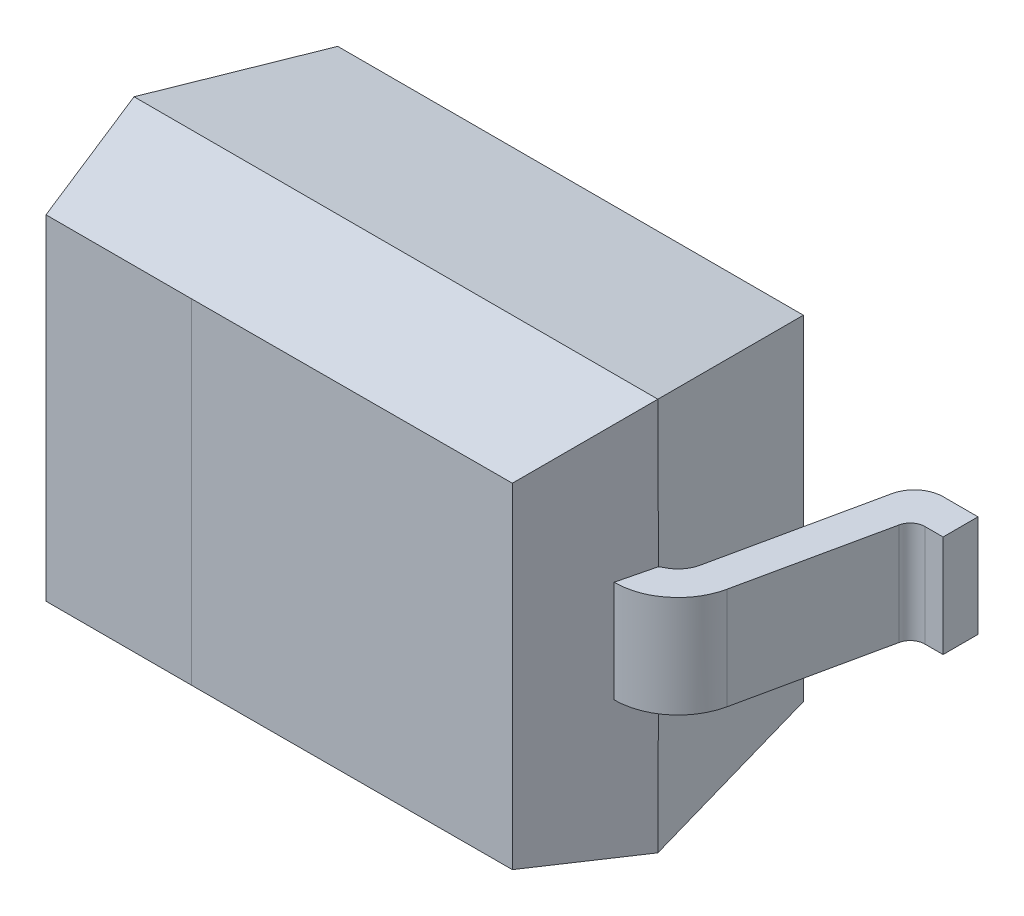
ISO-10303-21;
HEADER;
FILE_DESCRIPTION(('STEP AP214'),'2;1');
FILE_NAME('part.step','',(''),(''),'','','');
FILE_SCHEMA(('AUTOMOTIVE_DESIGN { 1 0 10303 214 1 1 1 1 }'));
ENDSEC;
DATA;
#1=APPLICATION_CONTEXT('core data for automotive mechanical design processes');
#2=APPLICATION_PROTOCOL_DEFINITION('international standard','automotive_design',2000,#1);
#3=PRODUCT_CONTEXT('',#1,'mechanical');
#4=PRODUCT('Part','Part','',(#3));
#5=PRODUCT_RELATED_PRODUCT_CATEGORY('part','',(#4));
#6=PRODUCT_DEFINITION_FORMATION('','',#4);
#7=PRODUCT_DEFINITION_CONTEXT('part definition',#1,'design');
#8=PRODUCT_DEFINITION('design','',#6,#7);
#9=PRODUCT_DEFINITION_SHAPE('','',#8);
#10=(LENGTH_UNIT() NAMED_UNIT(*) SI_UNIT(.MILLI.,.METRE.));
#11=(NAMED_UNIT(*) PLANE_ANGLE_UNIT() SI_UNIT($,.RADIAN.));
#12=(NAMED_UNIT(*) SI_UNIT($,.STERADIAN.) SOLID_ANGLE_UNIT());
#13=UNCERTAINTY_MEASURE_WITH_UNIT(LENGTH_MEASURE(1.E-05),#10,'distance_accuracy_value','');
#14=(GEOMETRIC_REPRESENTATION_CONTEXT(3) GLOBAL_UNCERTAINTY_ASSIGNED_CONTEXT((#13)) GLOBAL_UNIT_ASSIGNED_CONTEXT((#10,
#11,#12)) REPRESENTATION_CONTEXT('',''));
#15=CARTESIAN_POINT('',(0.,0.,0.));
#16=DIRECTION('',(0.,0.,1.));
#17=DIRECTION('',(1.,0.,0.));
#18=AXIS2_PLACEMENT_3D('',#15,#16,#17);
#19=CARTESIAN_POINT('',(1.16904360627857,0.,0.250509344159851));
#20=DIRECTION('',(-0.977802414084727,0.,-0.209529088696727));
#21=DIRECTION('',(-0.209529088696727,0.,0.977802414084727));
#22=AXIS2_PLACEMENT_3D('',#19,#20,#21);
#23=PLANE('',#22);
#24=DIRECTION('',(0.20952908959548,0.,-0.977802413892137));
#25=VECTOR('',#24,1.);
#26=CARTESIAN_POINT('',(1.084274952,-0.175,0.6460963995));
#27=LINE('',#26,#25);
#28=CARTESIAN_POINT('',(1.08427495207285,-0.175,0.646096399515253));
#29=VERTEX_POINT('',#28);
#30=CARTESIAN_POINT('',(1.18854056348352,-0.175,0.159523545518344));
#31=VERTEX_POINT('',#30);
#32=EDGE_CURVE('E198',#29,#31,#27,.T.);
#33=ORIENTED_EDGE('',*,*,#32,.T.);
#34=DIRECTION('',(0.,-1.,0.));
#35=VECTOR('',#34,1.);
#36=CARTESIAN_POINT('',(1.18854056331954,0.,0.159523545454188));
#37=LINE('',#36,#35);
#38=CARTESIAN_POINT('',(1.18854056348402,0.175,0.159523545516934));
#39=VERTEX_POINT('',#38);
#40=EDGE_CURVE('E192',#31,#39,#37,.F.);
#41=ORIENTED_EDGE('',*,*,#40,.T.);
#42=DIRECTION('',(-0.20952908959548,0.,0.977802413892137));
#43=VECTOR('',#42,1.);
#44=CARTESIAN_POINT('',(1.188540564,0.175,0.1595235456));
#45=LINE('',#44,#43);
#46=CARTESIAN_POINT('',(1.08427495207402,0.175,0.646096399513896));
#47=VERTEX_POINT('',#46);
#48=EDGE_CURVE('E195',#39,#47,#45,.T.);
#49=ORIENTED_EDGE('',*,*,#48,.T.);
#50=DIRECTION('',(0.,-1.,0.));
#51=VECTOR('',#50,1.);
#52=CARTESIAN_POINT('',(1.08427495209703,0.,0.646096399520792));
#53=LINE('',#52,#51);
#54=EDGE_CURVE('E221',#47,#29,#53,.T.);
#55=ORIENTED_EDGE('',*,*,#54,.T.);
#56=EDGE_LOOP('',(#33,#41,#49,#55));
#57=FACE_BOUND('',#56,.T.);
#58=ADVANCED_FACE('F16',(#57),#23,.F.);
#59=CARTESIAN_POINT('',(1.237430684,-0.175,0.17));
#60=DIRECTION('',(0.,1.,0.));
#61=DIRECTION('',(0.,0.,1.));
#62=AXIS2_PLACEMENT_3D('',#59,#60,#61);
#63=CYLINDRICAL_SURFACE('',#62,0.05);
#64=CARTESIAN_POINT('',(1.237430684,-0.175,0.17));
#65=DIRECTION('',(0.,-1.,0.));
#66=DIRECTION('',(-0.977802413609116,0.,-0.209529090916243));
#67=AXIS2_PLACEMENT_3D('',#64,#65,#66);
#68=CIRCLE('',#67,0.0500000000000001);
#69=CARTESIAN_POINT('',(1.23743068399852,-0.175,0.119999999999805));
#70=VERTEX_POINT('',#69);
#71=EDGE_CURVE('E609',#31,#70,#68,.T.);
#72=ORIENTED_EDGE('',*,*,#71,.T.);
#73=DIRECTION('',(0.,1.,0.));
#74=VECTOR('',#73,1.);
#75=CARTESIAN_POINT('',(1.237430684,0.,0.12));
#76=LINE('',#75,#74);
#77=CARTESIAN_POINT('',(1.237430684,0.175,0.12));
#78=VERTEX_POINT('',#77);
#79=EDGE_CURVE('E201',#70,#78,#76,.T.);
#80=ORIENTED_EDGE('',*,*,#79,.T.);
#81=CARTESIAN_POINT('',(1.237430684,0.175,0.17));
#82=DIRECTION('',(0.,1.,0.));
#83=DIRECTION('',(0.,0.,-1.));
#84=AXIS2_PLACEMENT_3D('',#81,#82,#83);
#85=CIRCLE('',#84,0.05);
#86=EDGE_CURVE('E204',#78,#39,#85,.T.);
#87=ORIENTED_EDGE('',*,*,#86,.T.);
#88=ORIENTED_EDGE('',*,*,#40,.F.);
#89=EDGE_LOOP('',(#72,#80,#87,#88));
#90=FACE_BOUND('',#89,.T.);
#91=ADVANCED_FACE('F206',(#90),#63,.F.);
#92=CARTESIAN_POINT('',(0.,0.,0.12));
#93=DIRECTION('',(0.,0.,1.));
#94=DIRECTION('',(1.,0.,0.));
#95=AXIS2_PLACEMENT_3D('',#92,#93,#94);
#96=PLANE('',#95);
#97=DIRECTION('',(1.,0.,0.));
#98=VECTOR('',#97,1.);
#99=CARTESIAN_POINT('',(0.,-0.175,0.12));
#100=LINE('',#99,#98);
#101=CARTESIAN_POINT('',(1.3,-0.175,0.12));
#102=VERTEX_POINT('',#101);
#103=EDGE_CURVE('E650',#70,#102,#100,.T.);
#104=ORIENTED_EDGE('',*,*,#103,.T.);
#105=DIRECTION('',(0.,1.,0.));
#106=VECTOR('',#105,1.);
#107=CARTESIAN_POINT('',(1.3,0.,0.12));
#108=LINE('',#107,#106);
#109=CARTESIAN_POINT('',(1.3,0.175,0.12));
#110=VERTEX_POINT('',#109);
#111=EDGE_CURVE('E922',#102,#110,#108,.T.);
#112=ORIENTED_EDGE('',*,*,#111,.T.);
#113=DIRECTION('',(1.,0.,0.));
#114=VECTOR('',#113,1.);
#115=CARTESIAN_POINT('',(0.,0.175,0.12));
#116=LINE('',#115,#114);
#117=EDGE_CURVE('E212',#110,#78,#116,.F.);
#118=ORIENTED_EDGE('',*,*,#117,.T.);
#119=ORIENTED_EDGE('',*,*,#79,.F.);
#120=EDGE_LOOP('',(#104,#112,#118,#119));
#121=FACE_BOUND('',#120,.T.);
#122=ADVANCED_FACE('F945',(#121),#96,.T.);
#123=CARTESIAN_POINT('',(1.3,0.,0.));
#124=DIRECTION('',(1.,0.,0.));
#125=DIRECTION('',(0.,0.,-1.));
#126=AXIS2_PLACEMENT_3D('',#123,#124,#125);
#127=PLANE('',#126);
#128=DIRECTION('',(0.,0.,1.));
#129=VECTOR('',#128,1.);
#130=CARTESIAN_POINT('',(1.3,-0.175,0.));
#131=LINE('',#130,#129);
#132=CARTESIAN_POINT('',(1.3,-0.175,0.));
#133=VERTEX_POINT('',#132);
#134=EDGE_CURVE('E647',#102,#133,#131,.F.);
#135=ORIENTED_EDGE('',*,*,#134,.T.);
#136=DIRECTION('',(0.,1.,0.));
#137=VECTOR('',#136,1.);
#138=CARTESIAN_POINT('',(1.3,0.,0.));
#139=LINE('',#138,#137);
#140=CARTESIAN_POINT('',(1.3,0.175,0.));
#141=VERTEX_POINT('',#140);
#142=EDGE_CURVE('E918',#133,#141,#139,.T.);
#143=ORIENTED_EDGE('',*,*,#142,.T.);
#144=DIRECTION('',(0.,0.,1.));
#145=VECTOR('',#144,1.);
#146=CARTESIAN_POINT('',(1.3,0.175,0.));
#147=LINE('',#146,#145);
#148=EDGE_CURVE('E230',#141,#110,#147,.T.);
#149=ORIENTED_EDGE('',*,*,#148,.T.);
#150=ORIENTED_EDGE('',*,*,#111,.F.);
#151=EDGE_LOOP('',(#135,#143,#149,#150));
#152=FACE_BOUND('',#151,.T.);
#153=ADVANCED_FACE('F960',(#152),#127,.T.);
#154=CARTESIAN_POINT('',(0.,0.,0.));
#155=DIRECTION('',(0.,0.,-1.));
#156=DIRECTION('',(-1.,0.,0.));
#157=AXIS2_PLACEMENT_3D('',#154,#155,#156);
#158=PLANE('',#157);
#159=DIRECTION('',(1.,0.,0.));
#160=VECTOR('',#159,1.);
#161=CARTESIAN_POINT('',(0.,-0.175,0.));
#162=LINE('',#161,#160);
#163=CARTESIAN_POINT('',(1.180841579,-0.175,0.));
#164=VERTEX_POINT('',#163);
#165=EDGE_CURVE('E645',#133,#164,#162,.F.);
#166=ORIENTED_EDGE('',*,*,#165,.T.);
#167=DIRECTION('',(0.,1.,0.));
#168=VECTOR('',#167,1.);
#169=CARTESIAN_POINT('',(1.180841579,0.,0.));
#170=LINE('',#169,#168);
#171=CARTESIAN_POINT('',(1.180841579,0.175,-3.90519458133912E-13));
#172=VERTEX_POINT('',#171);
#173=EDGE_CURVE('E910',#164,#172,#170,.T.);
#174=ORIENTED_EDGE('',*,*,#173,.T.);
#175=DIRECTION('',(1.,0.,0.));
#176=VECTOR('',#175,1.);
#177=CARTESIAN_POINT('',(0.,0.175,0.));
#178=LINE('',#177,#176);
#179=EDGE_CURVE('E233',#172,#141,#178,.T.);
#180=ORIENTED_EDGE('',*,*,#179,.T.);
#181=ORIENTED_EDGE('',*,*,#142,.F.);
#182=EDGE_LOOP('',(#166,#174,#180,#181));
#183=FACE_BOUND('',#182,.T.);
#184=ADVANCED_FACE('F900',(#183),#158,.T.);
#185=CARTESIAN_POINT('',(1.180841579,-0.175,0.1));
#186=DIRECTION('',(0.,1.,0.));
#187=DIRECTION('',(0.,0.,1.));
#188=AXIS2_PLACEMENT_3D('',#185,#186,#187);
#189=CYLINDRICAL_SURFACE('',#188,0.1);
#190=CARTESIAN_POINT('',(1.180841579,-0.175,0.1));
#191=DIRECTION('',(0.,1.,0.));
#192=DIRECTION('',(0.,0.,-1.));
#193=AXIS2_PLACEMENT_3D('',#190,#191,#192);
#194=CIRCLE('',#193,0.1);
#195=CARTESIAN_POINT('',(1.08306133758426,-0.175,0.0790470910628771));
#196=VERTEX_POINT('',#195);
#197=EDGE_CURVE('E622',#164,#196,#194,.T.);
#198=ORIENTED_EDGE('',*,*,#197,.T.);
#199=DIRECTION('',(0.,1.,0.));
#200=VECTOR('',#199,1.);
#201=CARTESIAN_POINT('',(1.08306133713598,0.,0.0790470909448536));
#202=LINE('',#201,#200);
#203=CARTESIAN_POINT('',(1.08306133758388,0.175,0.0790470910627953));
#204=VERTEX_POINT('',#203);
#205=EDGE_CURVE('E917',#196,#204,#202,.T.);
#206=ORIENTED_EDGE('',*,*,#205,.T.);
#207=CARTESIAN_POINT('',(1.180841579,0.175,0.1));
#208=DIRECTION('',(0.,-1.,0.));
#209=DIRECTION('',(-0.977802413904727,0.,-0.209529089536726));
#210=AXIS2_PLACEMENT_3D('',#207,#208,#209);
#211=CIRCLE('',#210,0.1);
#212=EDGE_CURVE('E236',#204,#172,#211,.T.);
#213=ORIENTED_EDGE('',*,*,#212,.T.);
#214=ORIENTED_EDGE('',*,*,#173,.F.);
#215=EDGE_LOOP('',(#198,#206,#213,#214));
#216=FACE_BOUND('',#215,.T.);
#217=ADVANCED_FACE('F891',(#216),#189,.T.);
#218=CARTESIAN_POINT('',(1.05170731659023,0.,0.225365853516636));
#219=DIRECTION('',(-0.977802414084727,0.,-0.209529088696727));
#220=DIRECTION('',(-0.209529088696727,0.,0.977802414084727));
#221=AXIS2_PLACEMENT_3D('',#218,#219,#220);
#222=PLANE('',#221);
#223=DIRECTION('',(-0.209529089358092,0.,0.977802413943005));
#224=VECTOR('',#223,1.);
#225=CARTESIAN_POINT('',(1.083061338,-0.175,0.07904709113));
#226=LINE('',#225,#224);
#227=CARTESIAN_POINT('',(0.966938662391205,-0.175,0.62095290889008));
#228=VERTEX_POINT('',#227);
#229=EDGE_CURVE('E636',#196,#228,#226,.T.);
#230=ORIENTED_EDGE('',*,*,#229,.T.);
#231=DIRECTION('',(0.,-1.,0.));
#232=VECTOR('',#231,1.);
#233=CARTESIAN_POINT('',(0.96693866237741,0.,0.620952908895159));
#234=LINE('',#233,#232);
#235=CARTESIAN_POINT('',(0.966938662390551,0.175,0.620952908891951));
#236=VERTEX_POINT('',#235);
#237=EDGE_CURVE('E858',#228,#236,#234,.F.);
#238=ORIENTED_EDGE('',*,*,#237,.T.);
#239=DIRECTION('',(0.209529089358092,0.,-0.977802413943005));
#240=VECTOR('',#239,1.);
#241=CARTESIAN_POINT('',(0.9669386624,0.175,0.6209529089));
#242=LINE('',#241,#240);
#243=EDGE_CURVE('E239',#236,#204,#242,.T.);
#244=ORIENTED_EDGE('',*,*,#243,.T.);
#245=ORIENTED_EDGE('',*,*,#205,.F.);
#246=EDGE_LOOP('',(#230,#238,#244,#245));
#247=FACE_BOUND('',#246,.T.);
#248=ADVANCED_FACE('F871',(#247),#222,.T.);
#249=CARTESIAN_POINT('',(0.869158421,-0.175,0.6));
#250=DIRECTION('',(0.,1.,0.));
#251=DIRECTION('',(0.,0.,1.));
#252=AXIS2_PLACEMENT_3D('',#249,#250,#251);
#253=CYLINDRICAL_SURFACE('',#252,0.0999999999749672);
#254=CARTESIAN_POINT('',(0.869158421,0.175,0.6));
#255=DIRECTION('',(0.,1.,0.));
#256=DIRECTION('',(0.300702141075275,0.,0.953718104238745));
#257=AXIS2_PLACEMENT_3D('',#254,#255,#256);
#258=CIRCLE('',#257,0.0999999999749672);
#259=CARTESIAN_POINT('',(0.899614317740163,0.175,0.697685905255895));
#260=VERTEX_POINT('',#259);
#261=EDGE_CURVE('E242',#260,#236,#258,.T.);
#262=ORIENTED_EDGE('',*,*,#261,.T.);
#263=ORIENTED_EDGE('',*,*,#237,.F.);
#264=CARTESIAN_POINT('',(0.869158421,-0.175,0.6));
#265=DIRECTION('',(0.,-1.,0.));
#266=DIRECTION('',(0.977802414018873,0.,0.209529089004044));
#267=AXIS2_PLACEMENT_3D('',#264,#265,#266);
#268=CIRCLE('',#267,0.0999999999749672);
#269=CARTESIAN_POINT('',(0.899614317741464,-0.175,0.697685905255658));
#270=VERTEX_POINT('',#269);
#271=EDGE_CURVE('E594',#228,#270,#268,.T.);
#272=ORIENTED_EDGE('',*,*,#271,.T.);
#273=DIRECTION('',(0.,1.,0.));
#274=VECTOR('',#273,1.);
#275=CARTESIAN_POINT('',(0.899228635057704,0.,0.69537181040705));
#276=LINE('',#275,#274);
#277=EDGE_CURVE('E586',#270,#260,#276,.T.);
#278=ORIENTED_EDGE('',*,*,#277,.T.);
#279=EDGE_LOOP('',(#262,#263,#272,#278));
#280=FACE_BOUND('',#279,.T.);
#281=ADVANCED_FACE('F860',(#280),#253,.F.);
#282=CARTESIAN_POINT('',(-1.16904360627857,0.,0.250509344159851));
#283=DIRECTION('',(-0.977802414084727,0.,0.209529088696727));
#284=DIRECTION('',(0.209529088696727,0.,0.977802414084727));
#285=AXIS2_PLACEMENT_3D('',#282,#283,#284);
#286=PLANE('',#285);
#287=DIRECTION('',(0.20952908959548,0.,0.977802413892137));
#288=VECTOR('',#287,1.);
#289=CARTESIAN_POINT('',(-1.188540564,-0.175,0.1595235456));
#290=LINE('',#289,#288);
#291=CARTESIAN_POINT('',(-1.18854056382425,-0.175,0.15952354558984));
#292=VERTEX_POINT('',#291);
#293=CARTESIAN_POINT('',(-1.0842749520255,-0.175,0.6460963995035));
#294=VERTEX_POINT('',#293);
#295=EDGE_CURVE('E544',#292,#294,#290,.T.);
#296=ORIENTED_EDGE('',*,*,#295,.T.);
#297=DIRECTION('',(0.,1.,0.));
#298=VECTOR('',#297,1.);
#299=CARTESIAN_POINT('',(-1.084274952,0.,0.6460963995));
#300=LINE('',#299,#298);
#301=CARTESIAN_POINT('',(-1.08427495202433,0.175,0.646096399504857));
#302=VERTEX_POINT('',#301);
#303=EDGE_CURVE('E1015',#294,#302,#300,.T.);
#304=ORIENTED_EDGE('',*,*,#303,.T.);
#305=DIRECTION('',(-0.20952908959548,0.,-0.977802413892137));
#306=VECTOR('',#305,1.);
#307=CARTESIAN_POINT('',(-1.084274952,0.175,0.6460963995));
#308=LINE('',#307,#306);
#309=CARTESIAN_POINT('',(-1.18854056382375,0.175,0.15952354559125));
#310=VERTEX_POINT('',#309);
#311=EDGE_CURVE('E462',#302,#310,#308,.T.);
#312=ORIENTED_EDGE('',*,*,#311,.T.);
#313=DIRECTION('',(0.,1.,0.));
#314=VECTOR('',#313,1.);
#315=CARTESIAN_POINT('',(-1.188540564,0.,0.1595235456));
#316=LINE('',#315,#314);
#317=EDGE_CURVE('E995',#310,#292,#316,.F.);
#318=ORIENTED_EDGE('',*,*,#317,.T.);
#319=EDGE_LOOP('',(#296,#304,#312,#318));
#320=FACE_BOUND('',#319,.T.);
#321=ADVANCED_FACE('F870',(#320),#286,.T.);
#322=CARTESIAN_POINT('',(-1.237430684,-0.175,0.17));
#323=DIRECTION('',(0.,1.,0.));
#324=DIRECTION('',(0.,0.,1.));
#325=AXIS2_PLACEMENT_3D('',#322,#323,#324);
#326=CYLINDRICAL_SURFACE('',#325,0.0499999993040961);
#327=CARTESIAN_POINT('',(-1.237430684,-0.175,0.17));
#328=DIRECTION('',(0.,-1.,0.));
#329=DIRECTION('',(0.,0.,-1.));
#330=AXIS2_PLACEMENT_3D('',#327,#328,#329);
#331=CIRCLE('',#330,0.0499999993040961);
#332=CARTESIAN_POINT('',(-1.237430684,-0.175,0.120000000173976));
#333=VERTEX_POINT('',#332);
#334=EDGE_CURVE('E552',#333,#292,#331,.T.);
#335=ORIENTED_EDGE('',*,*,#334,.T.);
#336=ORIENTED_EDGE('',*,*,#317,.F.);
#337=CARTESIAN_POINT('',(-1.237430684,0.175,0.17));
#338=DIRECTION('',(0.,1.,0.));
#339=DIRECTION('',(0.977802413609116,0.,-0.209529090916242));
#340=AXIS2_PLACEMENT_3D('',#337,#338,#339);
#341=CIRCLE('',#340,0.0499999993040961);
#342=CARTESIAN_POINT('',(-1.23743068399852,0.175,0.120000000173781));
#343=VERTEX_POINT('',#342);
#344=EDGE_CURVE('E459',#310,#343,#341,.T.);
#345=ORIENTED_EDGE('',*,*,#344,.T.);
#346=DIRECTION('',(0.,1.,0.));
#347=VECTOR('',#346,1.);
#348=CARTESIAN_POINT('',(-1.237430684,0.,0.12));
#349=LINE('',#348,#347);
#350=EDGE_CURVE('E996',#343,#333,#349,.F.);
#351=ORIENTED_EDGE('',*,*,#350,.T.);
#352=EDGE_LOOP('',(#335,#336,#345,#351));
#353=FACE_BOUND('',#352,.T.);
#354=ADVANCED_FACE('F1041',(#353),#326,.F.);
#355=CARTESIAN_POINT('',(0.,0.,0.12));
#356=DIRECTION('',(0.,0.,1.));
#357=DIRECTION('',(1.,0.,0.));
#358=AXIS2_PLACEMENT_3D('',#355,#356,#357);
#359=PLANE('',#358);
#360=DIRECTION('',(1.,0.,0.));
#361=VECTOR('',#360,1.);
#362=CARTESIAN_POINT('',(0.,-0.175,0.12));
#363=LINE('',#362,#361);
#364=CARTESIAN_POINT('',(-1.3,-0.175,0.12));
#365=VERTEX_POINT('',#364);
#366=EDGE_CURVE('E555',#365,#333,#363,.T.);
#367=ORIENTED_EDGE('',*,*,#366,.T.);
#368=ORIENTED_EDGE('',*,*,#350,.F.);
#369=DIRECTION('',(1.,0.,0.));
#370=VECTOR('',#369,1.);
#371=CARTESIAN_POINT('',(0.,0.175,0.12));
#372=LINE('',#371,#370);
#373=CARTESIAN_POINT('',(-1.3,0.175,0.12));
#374=VERTEX_POINT('',#373);
#375=EDGE_CURVE('E457',#343,#374,#372,.F.);
#376=ORIENTED_EDGE('',*,*,#375,.T.);
#377=DIRECTION('',(0.,1.,0.));
#378=VECTOR('',#377,1.);
#379=CARTESIAN_POINT('',(-1.3,0.,0.12));
#380=LINE('',#379,#378);
#381=EDGE_CURVE('E1001',#374,#365,#380,.F.);
#382=ORIENTED_EDGE('',*,*,#381,.T.);
#383=EDGE_LOOP('',(#367,#368,#376,#382));
#384=FACE_BOUND('',#383,.T.);
#385=ADVANCED_FACE('F1050',(#384),#359,.T.);
#386=CARTESIAN_POINT('',(-1.3,0.,0.));
#387=DIRECTION('',(1.,0.,0.));
#388=DIRECTION('',(0.,0.,-1.));
#389=AXIS2_PLACEMENT_3D('',#386,#387,#388);
#390=PLANE('',#389);
#391=DIRECTION('',(0.,0.,1.));
#392=VECTOR('',#391,1.);
#393=CARTESIAN_POINT('',(-1.3,-0.175,0.));
#394=LINE('',#393,#392);
#395=CARTESIAN_POINT('',(-1.3,-0.175,0.));
#396=VERTEX_POINT('',#395);
#397=EDGE_CURVE('E558',#396,#365,#394,.T.);
#398=ORIENTED_EDGE('',*,*,#397,.T.);
#399=ORIENTED_EDGE('',*,*,#381,.F.);
#400=DIRECTION('',(0.,0.,1.));
#401=VECTOR('',#400,1.);
#402=CARTESIAN_POINT('',(-1.3,0.175,0.));
#403=LINE('',#402,#401);
#404=CARTESIAN_POINT('',(-1.3,0.175,0.));
#405=VERTEX_POINT('',#404);
#406=EDGE_CURVE('E454',#374,#405,#403,.F.);
#407=ORIENTED_EDGE('',*,*,#406,.T.);
#408=DIRECTION('',(0.,1.,0.));
#409=VECTOR('',#408,1.);
#410=CARTESIAN_POINT('',(-1.3,0.,0.));
#411=LINE('',#410,#409);
#412=EDGE_CURVE('E1089',#405,#396,#411,.F.);
#413=ORIENTED_EDGE('',*,*,#412,.T.);
#414=EDGE_LOOP('',(#398,#399,#407,#413));
#415=FACE_BOUND('',#414,.T.);
#416=ADVANCED_FACE('F1054',(#415),#390,.F.);
#417=CARTESIAN_POINT('',(0.,0.,0.));
#418=DIRECTION('',(0.,0.,-1.));
#419=DIRECTION('',(-1.,0.,0.));
#420=AXIS2_PLACEMENT_3D('',#417,#418,#419);
#421=PLANE('',#420);
#422=DIRECTION('',(1.,0.,0.));
#423=VECTOR('',#422,1.);
#424=CARTESIAN_POINT('',(0.,-0.175,0.));
#425=LINE('',#424,#423);
#426=CARTESIAN_POINT('',(-1.180841579,-0.175,1.99277792482582E-10));
#427=VERTEX_POINT('',#426);
#428=EDGE_CURVE('E561',#427,#396,#425,.F.);
#429=ORIENTED_EDGE('',*,*,#428,.T.);
#430=ORIENTED_EDGE('',*,*,#412,.F.);
#431=DIRECTION('',(1.,0.,0.));
#432=VECTOR('',#431,1.);
#433=CARTESIAN_POINT('',(0.,0.175,0.));
#434=LINE('',#433,#432);
#435=CARTESIAN_POINT('',(-1.180841579,0.175,1.99668311940716E-10));
#436=VERTEX_POINT('',#435);
#437=EDGE_CURVE('E449',#405,#436,#434,.T.);
#438=ORIENTED_EDGE('',*,*,#437,.T.);
#439=DIRECTION('',(0.,-1.,0.));
#440=VECTOR('',#439,1.);
#441=CARTESIAN_POINT('',(-1.180841579,0.,3.99336596776378E-10));
#442=LINE('',#441,#440);
#443=EDGE_CURVE('E1084',#436,#427,#442,.T.);
#444=ORIENTED_EDGE('',*,*,#443,.T.);
#445=EDGE_LOOP('',(#429,#430,#438,#444));
#446=FACE_BOUND('',#445,.T.);
#447=ADVANCED_FACE('F1058',(#446),#421,.T.);
#448=CARTESIAN_POINT('',(-1.180841579,-0.175,0.1));
#449=DIRECTION('',(0.,1.,0.));
#450=DIRECTION('',(0.,0.,1.));
#451=AXIS2_PLACEMENT_3D('',#448,#449,#450);
#452=CYLINDRICAL_SURFACE('',#451,0.0999999996006634);
#453=CARTESIAN_POINT('',(-1.180841579,-0.175,0.1));
#454=DIRECTION('',(0.,1.,0.));
#455=DIRECTION('',(0.977802413904727,0.,-0.209529089536726));
#456=AXIS2_PLACEMENT_3D('',#453,#454,#455);
#457=CIRCLE('',#456,0.0999999996006634);
#458=CARTESIAN_POINT('',(-1.0830613376815,-0.175,0.0790470910837134));
#459=VERTEX_POINT('',#458);
#460=EDGE_CURVE('E564',#459,#427,#457,.T.);
#461=ORIENTED_EDGE('',*,*,#460,.T.);
#462=ORIENTED_EDGE('',*,*,#443,.F.);
#463=CARTESIAN_POINT('',(-1.180841579,0.175,0.1));
#464=DIRECTION('',(0.,-1.,0.));
#465=DIRECTION('',(0.,0.,-1.));
#466=AXIS2_PLACEMENT_3D('',#463,#464,#465);
#467=CIRCLE('',#466,0.0999999996006634);
#468=CARTESIAN_POINT('',(-1.08306133768188,0.175,0.0790470910837952));
#469=VERTEX_POINT('',#468);
#470=EDGE_CURVE('E446',#436,#469,#467,.T.);
#471=ORIENTED_EDGE('',*,*,#470,.T.);
#472=DIRECTION('',(0.,1.,0.));
#473=VECTOR('',#472,1.);
#474=CARTESIAN_POINT('',(-1.08306133713598,0.,0.0790470909448536));
#475=LINE('',#474,#473);
#476=EDGE_CURVE('E818',#469,#459,#475,.F.);
#477=ORIENTED_EDGE('',*,*,#476,.T.);
#478=EDGE_LOOP('',(#461,#462,#471,#477));
#479=FACE_BOUND('',#478,.T.);
#480=ADVANCED_FACE('F1061',(#479),#452,.T.);
#481=CARTESIAN_POINT('',(-1.05170731659023,0.,0.225365853516636));
#482=DIRECTION('',(-0.977802414084727,0.,0.209529088696727));
#483=DIRECTION('',(0.209529088696727,0.,0.977802414084727));
#484=AXIS2_PLACEMENT_3D('',#481,#482,#483);
#485=PLANE('',#484);
#486=DIRECTION('',(-0.209529089358092,0.,-0.977802413943005));
#487=VECTOR('',#486,1.);
#488=CARTESIAN_POINT('',(-0.9669386624,-0.175,0.6209529089));
#489=LINE('',#488,#487);
#490=CARTESIAN_POINT('',(-0.966938662401846,-0.175,0.620952908894372));
#491=VERTEX_POINT('',#490);
#492=EDGE_CURVE('E567',#491,#459,#489,.T.);
#493=ORIENTED_EDGE('',*,*,#492,.T.);
#494=ORIENTED_EDGE('',*,*,#476,.F.);
#495=DIRECTION('',(0.209529089358092,0.,0.977802413943005));
#496=VECTOR('',#495,1.);
#497=CARTESIAN_POINT('',(-1.083061338,0.175,0.07904709113));
#498=LINE('',#497,#496);
#499=CARTESIAN_POINT('',(-0.9669386624025,0.175,0.6209529088925));
#500=VERTEX_POINT('',#499);
#501=EDGE_CURVE('E440',#469,#500,#498,.T.);
#502=ORIENTED_EDGE('',*,*,#501,.T.);
#503=DIRECTION('',(0.,1.,0.));
#504=VECTOR('',#503,1.);
#505=CARTESIAN_POINT('',(-0.9669386624,0.,0.6209529089));
#506=LINE('',#505,#504);
#507=EDGE_CURVE('E816',#500,#491,#506,.F.);
#508=ORIENTED_EDGE('',*,*,#507,.T.);
#509=EDGE_LOOP('',(#493,#494,#502,#508));
#510=FACE_BOUND('',#509,.T.);
#511=ADVANCED_FACE('F837',(#510),#485,.F.);
#512=CARTESIAN_POINT('',(-0.869158421,-0.175,0.6));
#513=DIRECTION('',(0.,1.,0.));
#514=DIRECTION('',(0.,0.,1.));
#515=AXIS2_PLACEMENT_3D('',#512,#513,#514);
#516=CYLINDRICAL_SURFACE('',#515,0.0999999999980699);
#517=CARTESIAN_POINT('',(-0.869158421,-0.175,0.6));
#518=DIRECTION('',(0.,-1.,0.));
#519=DIRECTION('',(-0.300702141075275,0.,0.953718104238745));
#520=AXIS2_PLACEMENT_3D('',#517,#518,#519);
#521=CIRCLE('',#520,0.0999999999980698);
#522=CARTESIAN_POINT('',(-0.899614317741321,-0.175,0.697685905259567));
#523=VERTEX_POINT('',#522);
#524=EDGE_CURVE('E512',#523,#491,#521,.T.);
#525=ORIENTED_EDGE('',*,*,#524,.T.);
#526=ORIENTED_EDGE('',*,*,#507,.F.);
#527=CARTESIAN_POINT('',(-0.869158421,0.175,0.6));
#528=DIRECTION('',(0.,1.,0.));
#529=DIRECTION('',(-0.977802414018873,0.,0.209529089004044));
#530=AXIS2_PLACEMENT_3D('',#527,#528,#529);
#531=CIRCLE('',#530,0.0999999999980699);
#532=CARTESIAN_POINT('',(-0.899614317742621,0.175,0.69768590525933));
#533=VERTEX_POINT('',#532);
#534=EDGE_CURVE('E385',#500,#533,#531,.T.);
#535=ORIENTED_EDGE('',*,*,#534,.T.);
#536=DIRECTION('',(0.,1.,0.));
#537=VECTOR('',#536,1.);
#538=CARTESIAN_POINT('',(-0.899228635057704,0.,0.69537181040705));
#539=LINE('',#538,#537);
#540=EDGE_CURVE('E378',#533,#523,#539,.F.);
#541=ORIENTED_EDGE('',*,*,#540,.T.);
#542=EDGE_LOOP('',(#525,#526,#535,#541));
#543=FACE_BOUND('',#542,.T.);
#544=ADVANCED_FACE('F827',(#543),#516,.F.);
#545=CARTESIAN_POINT('',(0.,0.543243243287631,-0.0905405405479386));
#546=DIRECTION('',(0.,0.986393923832144,-0.164398987305357));
#547=DIRECTION('',(0.,0.164398987305357,0.986393923832144));
#548=AXIS2_PLACEMENT_3D('',#545,#546,#547);
#549=PLANE('',#548);
#550=DIRECTION('',(1.,0.,0.));
#551=VECTOR('',#550,1.);
#552=CARTESIAN_POINT('',(0.,0.575,0.1));
#553=LINE('',#552,#551);
#554=CARTESIAN_POINT('',(0.799999999993424,0.575,0.100000000001096));
#555=VERTEX_POINT('',#554);
#556=CARTESIAN_POINT('',(-0.799999999990136,0.575,0.100000000001096));
#557=VERTEX_POINT('',#556);
#558=EDGE_CURVE('E814',#555,#557,#553,.F.);
#559=ORIENTED_EDGE('',*,*,#558,.T.);
#560=DIRECTION('',(-0.162221421130763,0.162221421130763,0.973328526784575));
#561=VECTOR('',#560,1.);
#562=CARTESIAN_POINT('',(-0.799999999990136,0.575,0.100000000001644));
#563=LINE('',#562,#561);
#564=CARTESIAN_POINT('',(-0.900000000295853,0.675000000007883,0.700000000052101));
#565=VERTEX_POINT('',#564);
#566=EDGE_CURVE('E381',#557,#565,#563,.T.);
#567=ORIENTED_EDGE('',*,*,#566,.T.);
#568=DIRECTION('',(1.,0.,0.));
#569=VECTOR('',#568,1.);
#570=CARTESIAN_POINT('',(0.,0.67500000003153,0.700000000007882));
#571=LINE('',#570,#569);
#572=CARTESIAN_POINT('',(0.900000000202955,0.675000000014425,0.700000000091354));
#573=VERTEX_POINT('',#572);
#574=EDGE_CURVE('E365',#565,#573,#571,.T.);
#575=ORIENTED_EDGE('',*,*,#574,.T.);
#576=DIRECTION('',(-0.162221421130763,-0.162221421130763,-0.973328526784575));
#577=VECTOR('',#576,1.);
#578=CARTESIAN_POINT('',(0.899999999990136,0.675,0.700000000001644));
#579=LINE('',#578,#577);
#580=EDGE_CURVE('E593',#573,#555,#579,.T.);
#581=ORIENTED_EDGE('',*,*,#580,.T.);
#582=EDGE_LOOP('',(#559,#567,#575,#581));
#583=FACE_BOUND('',#582,.T.);
#584=ADVANCED_FACE('F813',(#583),#549,.T.);
#585=CARTESIAN_POINT('',(0.,0.,0.1));
#586=DIRECTION('',(0.,0.,1.));
#587=DIRECTION('',(1.,0.,0.));
#588=AXIS2_PLACEMENT_3D('',#585,#586,#587);
#589=PLANE('',#588);
#590=ORIENTED_EDGE('',*,*,#558,.F.);
#591=DIRECTION('',(0.,1.,0.));
#592=VECTOR('',#591,1.);
#593=CARTESIAN_POINT('',(0.799999999990136,0.,0.100000000001644));
#594=LINE('',#593,#592);
#595=CARTESIAN_POINT('',(0.799999999996712,-0.575000000029592,0.099999999995616));
#596=VERTEX_POINT('',#595);
#597=EDGE_CURVE('E756',#555,#596,#594,.F.);
#598=ORIENTED_EDGE('',*,*,#597,.T.);
#599=DIRECTION('',(1.,0.,0.));
#600=VECTOR('',#599,1.);
#601=CARTESIAN_POINT('',(0.,-0.575000000044388,0.0999999999926021));
#602=LINE('',#601,#600);
#603=CARTESIAN_POINT('',(-0.799999999996712,-0.575000000044388,0.099999999995616));
#604=VERTEX_POINT('',#603);
#605=EDGE_CURVE('E357',#596,#604,#602,.F.);
#606=ORIENTED_EDGE('',*,*,#605,.T.);
#607=DIRECTION('',(0.,1.,0.));
#608=VECTOR('',#607,1.);
#609=CARTESIAN_POINT('',(-0.799999999990136,0.,0.100000000001644));
#610=LINE('',#609,#608);
#611=EDGE_CURVE('E380',#604,#557,#610,.T.);
#612=ORIENTED_EDGE('',*,*,#611,.T.);
#613=EDGE_LOOP('',(#590,#598,#606,#612));
#614=FACE_BOUND('',#613,.T.);
#615=ADVANCED_FACE('F815',(#614),#589,.F.);
#616=CARTESIAN_POINT('',(0.,0.175,0.));
#617=DIRECTION('',(0.,1.,0.));
#618=DIRECTION('',(0.,0.,1.));
#619=AXIS2_PLACEMENT_3D('',#616,#617,#618);
#620=PLANE('',#619);
#621=ORIENTED_EDGE('',*,*,#48,.F.);
#622=ORIENTED_EDGE('',*,*,#86,.F.);
#623=ORIENTED_EDGE('',*,*,#117,.F.);
#624=ORIENTED_EDGE('',*,*,#148,.F.);
#625=ORIENTED_EDGE('',*,*,#179,.F.);
#626=ORIENTED_EDGE('',*,*,#212,.F.);
#627=ORIENTED_EDGE('',*,*,#243,.F.);
#628=ORIENTED_EDGE('',*,*,#261,.F.);
#629=CARTESIAN_POINT('',(0.900000000397759,0.175,0.70000000009944));
#630=DIRECTION('',(-0.242535625012804,0.,0.970142500151214));
#631=VECTOR('',#630,1.);
#632=LINE('',#629,#631);
#633=CARTESIAN_POINT('',(0.869554458377858,0.175,0.820099009344765));
#634=VERTEX_POINT('',#633);
#635=EDGE_CURVE('E250',#260,#634,#632,.T.);
#636=ORIENTED_EDGE('',*,*,#635,.T.);
#637=CARTESIAN_POINT('',(0.869158421006286,0.175,0.820000000003437));
#638=CARTESIAN_POINT('',(0.948154098695025,0.175,0.819433118282042));
#639=CARTESIAN_POINT('',(1.00746748091587,0.175,0.771086539349825));
#640=CARTESIAN_POINT('',(1.06738428154953,0.175,0.722248111616689));
#641=CARTESIAN_POINT('',(1.084274952102,0.175,0.646096399514));
#642=B_SPLINE_CURVE_WITH_KNOTS('',2,(#637,#638,#639,#640,#641),.UNSPECIFIED.,.F.,.F.,(3,2,3),
(0.,0.5,1.),.UNSPECIFIED.);
#643=EDGE_CURVE('E217',#634,#47,#642,.T.);
#644=ORIENTED_EDGE('',*,*,#643,.T.);
#645=EDGE_LOOP('',(#621,#622,#623,#624,#625,#626,#627,#628,#636,#644));
#646=FACE_BOUND('',#645,.T.);
#647=ADVANCED_FACE('F215',(#646),#620,.T.);
#648=CARTESIAN_POINT('',(0.869158421,-0.175,0.6));
#649=DIRECTION('',(0.,1.,0.));
#650=DIRECTION('',(0.,0.,1.));
#651=AXIS2_PLACEMENT_3D('',#648,#649,#650);
#652=CYLINDRICAL_SURFACE('',#651,0.22);
#653=CARTESIAN_POINT('',(0.869158421,-0.175,0.6));
#654=DIRECTION('',(0.,1.,0.));
#655=DIRECTION('',(0.,0.,1.));
#656=AXIS2_PLACEMENT_3D('',#653,#654,#655);
#657=CIRCLE('',#656,0.22);
#658=CARTESIAN_POINT('',(0.86955445837681,-0.175,0.820099009344192));
#659=VERTEX_POINT('',#658);
#660=EDGE_CURVE('E329',#659,#29,#657,.T.);
#661=ORIENTED_EDGE('',*,*,#660,.T.);
#662=ORIENTED_EDGE('',*,*,#54,.F.);
#663=ORIENTED_EDGE('',*,*,#643,.F.);
#664=CARTESIAN_POINT('',(0.869158421,0.175,0.82));
#665=DIRECTION('',(0.,-1.,0.));
#666=VECTOR('',#665,1.);
#667=LINE('',#664,#666);
#668=EDGE_CURVE('E293',#634,#659,#667,.T.);
#669=ORIENTED_EDGE('',*,*,#668,.T.);
#670=EDGE_LOOP('',(#661,#662,#663,#669));
#671=FACE_BOUND('',#670,.T.);
#672=ADVANCED_FACE('F301',(#671),#652,.T.);
#673=CARTESIAN_POINT('',(0.,-0.175,0.));
#674=DIRECTION('',(0.,1.,0.));
#675=DIRECTION('',(0.,0.,1.));
#676=AXIS2_PLACEMENT_3D('',#673,#674,#675);
#677=PLANE('',#676);
#678=ORIENTED_EDGE('',*,*,#271,.F.);
#679=ORIENTED_EDGE('',*,*,#229,.F.);
#680=ORIENTED_EDGE('',*,*,#197,.F.);
#681=ORIENTED_EDGE('',*,*,#165,.F.);
#682=ORIENTED_EDGE('',*,*,#134,.F.);
#683=ORIENTED_EDGE('',*,*,#103,.F.);
#684=ORIENTED_EDGE('',*,*,#71,.F.);
#685=ORIENTED_EDGE('',*,*,#32,.F.);
#686=ORIENTED_EDGE('',*,*,#660,.F.);
#687=CARTESIAN_POINT('',(0.86995049575362,-0.175,0.820198018688385));
#688=DIRECTION('',(0.242535625012804,0.,-0.970142500151214));
#689=VECTOR('',#688,1.);
#690=LINE('',#687,#689);
#691=EDGE_CURVE('E343',#659,#270,#690,.T.);
#692=ORIENTED_EDGE('',*,*,#691,.T.);
#693=EDGE_LOOP('',(#678,#679,#680,#681,#682,#683,#684,#685,#686,#692));
#694=FACE_BOUND('',#693,.T.);
#695=ADVANCED_FACE('F310',(#694),#677,.F.);
#696=CARTESIAN_POINT('',(0.762162162152298,0.,-0.127027027025383));
#697=DIRECTION('',(0.986393923832144,0.,-0.164398987305357));
#698=DIRECTION('',(-0.164398987305357,0.,-0.986393923832144));
#699=AXIS2_PLACEMENT_3D('',#696,#697,#698);
#700=PLANE('',#699);
#701=ORIENTED_EDGE('',*,*,#580,.F.);
#702=DIRECTION('',(0.,1.,0.));
#703=VECTOR('',#702,1.);
#704=CARTESIAN_POINT('',(0.900000000397759,0.,0.70000000009944));
#705=LINE('',#704,#703);
#706=EDGE_CURVE('E255',#573,#260,#705,.F.);
#707=ORIENTED_EDGE('',*,*,#706,.T.);
#708=ORIENTED_EDGE('',*,*,#277,.F.);
#709=DIRECTION('',(0.,1.,0.));
#710=VECTOR('',#709,1.);
#711=CARTESIAN_POINT('',(0.900000000397759,0.,0.70000000009944));
#712=LINE('',#711,#710);
#713=CARTESIAN_POINT('',(0.900000000150332,-0.675000000035917,0.700000000033989));
#714=VERTEX_POINT('',#713);
#715=EDGE_CURVE('E344',#270,#714,#712,.F.);
#716=ORIENTED_EDGE('',*,*,#715,.T.);
#717=DIRECTION('',(-0.162221421130763,0.162221421130763,-0.973328526784575));
#718=VECTOR('',#717,1.);
#719=CARTESIAN_POINT('',(0.9,-0.675000000044388,0.699999999992602));
#720=LINE('',#719,#718);
#721=EDGE_CURVE('E367',#714,#596,#720,.T.);
#722=ORIENTED_EDGE('',*,*,#721,.T.);
#723=ORIENTED_EDGE('',*,*,#597,.F.);
#724=EDGE_LOOP('',(#701,#707,#708,#716,#722,#723));
#725=FACE_BOUND('',#724,.T.);
#726=ADVANCED_FACE('F526',(#725),#700,.T.);
#727=CARTESIAN_POINT('',(0.,-0.175,0.));
#728=DIRECTION('',(0.,1.,0.));
#729=DIRECTION('',(0.,0.,1.));
#730=AXIS2_PLACEMENT_3D('',#727,#728,#729);
#731=PLANE('',#730);
#732=CARTESIAN_POINT('',(-0.869158421006286,-0.175,0.820000000003437));
#733=CARTESIAN_POINT('',(-0.948154098695016,-0.175,0.819433118282042));
#734=CARTESIAN_POINT('',(-1.00746748091587,-0.175,0.771086539349825));
#735=CARTESIAN_POINT('',(-1.06738428154953,-0.175,0.722248111616698));
#736=CARTESIAN_POINT('',(-1.084274952102,-0.175,0.646096399514));
#737=B_SPLINE_CURVE_WITH_KNOTS('',2,(#732,#733,#734,#735,#736),.UNSPECIFIED.,.F.,.F.,(3,2,3),
(0.,0.5,1.),.UNSPECIFIED.);
#738=CARTESIAN_POINT('',(-0.869554458377857,-0.175,0.820099009311688));
#739=VERTEX_POINT('',#738);
#740=EDGE_CURVE('E551',#739,#294,#737,.T.);
#741=ORIENTED_EDGE('',*,*,#740,.T.);
#742=ORIENTED_EDGE('',*,*,#295,.F.);
#743=ORIENTED_EDGE('',*,*,#334,.F.);
#744=ORIENTED_EDGE('',*,*,#366,.F.);
#745=ORIENTED_EDGE('',*,*,#397,.F.);
#746=ORIENTED_EDGE('',*,*,#428,.F.);
#747=ORIENTED_EDGE('',*,*,#460,.F.);
#748=ORIENTED_EDGE('',*,*,#492,.F.);
#749=ORIENTED_EDGE('',*,*,#524,.F.);
#750=CARTESIAN_POINT('',(-0.900000000397759,-0.175,0.70000000009944));
#751=DIRECTION('',(0.242535625012804,0.,0.970142500151214));
#752=VECTOR('',#751,1.);
#753=LINE('',#750,#752);
#754=EDGE_CURVE('E574',#523,#739,#753,.T.);
#755=ORIENTED_EDGE('',*,*,#754,.T.);
#756=EDGE_LOOP('',(#741,#742,#743,#744,#745,#746,#747,#748,#749,#755));
#757=FACE_BOUND('',#756,.T.);
#758=ADVANCED_FACE('F518',(#757),#731,.F.);
#759=CARTESIAN_POINT('',(-0.869158421,-0.175,0.6));
#760=DIRECTION('',(0.,1.,0.));
#761=DIRECTION('',(0.,0.,1.));
#762=AXIS2_PLACEMENT_3D('',#759,#760,#761);
#763=CYLINDRICAL_SURFACE('',#762,0.219999999900767);
#764=ORIENTED_EDGE('',*,*,#740,.F.);
#765=CARTESIAN_POINT('',(-0.869158421,-0.175,0.819999999900767));
#766=DIRECTION('',(0.,1.,0.));
#767=VECTOR('',#766,1.);
#768=LINE('',#765,#767);
#769=CARTESIAN_POINT('',(-0.86955445837681,0.175,0.820099009311115));
#770=VERTEX_POINT('',#769);
#771=EDGE_CURVE('E487',#739,#770,#768,.T.);
#772=ORIENTED_EDGE('',*,*,#771,.T.);
#773=CARTESIAN_POINT('',(-0.869158421,0.175,0.6));
#774=DIRECTION('',(0.,-1.,0.));
#775=DIRECTION('',(0.,0.,1.));
#776=AXIS2_PLACEMENT_3D('',#773,#774,#775);
#777=CIRCLE('',#776,0.219999999900767);
#778=EDGE_CURVE('E394',#770,#302,#777,.T.);
#779=ORIENTED_EDGE('',*,*,#778,.T.);
#780=ORIENTED_EDGE('',*,*,#303,.F.);
#781=EDGE_LOOP('',(#764,#772,#779,#780));
#782=FACE_BOUND('',#781,.T.);
#783=ADVANCED_FACE('F413',(#782),#763,.T.);
#784=CARTESIAN_POINT('',(0.,0.175,0.));
#785=DIRECTION('',(0.,1.,0.));
#786=DIRECTION('',(0.,0.,1.));
#787=AXIS2_PLACEMENT_3D('',#784,#785,#786);
#788=PLANE('',#787);
#789=ORIENTED_EDGE('',*,*,#501,.F.);
#790=ORIENTED_EDGE('',*,*,#470,.F.);
#791=ORIENTED_EDGE('',*,*,#437,.F.);
#792=ORIENTED_EDGE('',*,*,#406,.F.);
#793=ORIENTED_EDGE('',*,*,#375,.F.);
#794=ORIENTED_EDGE('',*,*,#344,.F.);
#795=ORIENTED_EDGE('',*,*,#311,.F.);
#796=ORIENTED_EDGE('',*,*,#778,.F.);
#797=CARTESIAN_POINT('',(-0.86995049575362,0.175,0.820198018688385));
#798=DIRECTION('',(-0.242535625012804,0.,-0.970142500151214));
#799=VECTOR('',#798,1.);
#800=LINE('',#797,#799);
#801=EDGE_CURVE('E375',#770,#533,#800,.T.);
#802=ORIENTED_EDGE('',*,*,#801,.T.);
#803=ORIENTED_EDGE('',*,*,#534,.F.);
#804=EDGE_LOOP('',(#789,#790,#791,#792,#793,#794,#795,#796,#802,#803));
#805=FACE_BOUND('',#804,.T.);
#806=ADVANCED_FACE('F402',(#805),#788,.T.);
#807=CARTESIAN_POINT('',(-0.762162162152298,0.,-0.127027027025383));
#808=DIRECTION('',(-0.986393923832144,0.,-0.164398987305357));
#809=DIRECTION('',(-0.164398987305357,0.,0.986393923832144));
#810=AXIS2_PLACEMENT_3D('',#807,#808,#809);
#811=PLANE('',#810);
#812=DIRECTION('',(-0.162221421130763,-0.162221421130763,0.973328526784575));
#813=VECTOR('',#812,1.);
#814=CARTESIAN_POINT('',(-0.8,-0.575000000044388,0.0999999999926021));
#815=LINE('',#814,#813);
#816=CARTESIAN_POINT('',(-0.90000000009944,-0.675000000034744,0.700000000026952));
#817=VERTEX_POINT('',#816);
#818=EDGE_CURVE('E352',#604,#817,#815,.T.);
#819=ORIENTED_EDGE('',*,*,#818,.T.);
#820=DIRECTION('',(0.,1.,0.));
#821=VECTOR('',#820,1.);
#822=CARTESIAN_POINT('',(-0.900000000397759,0.,0.70000000009944));
#823=LINE('',#822,#821);
#824=EDGE_CURVE('E728',#817,#523,#823,.T.);
#825=ORIENTED_EDGE('',*,*,#824,.T.);
#826=ORIENTED_EDGE('',*,*,#540,.F.);
#827=DIRECTION('',(0.,1.,0.));
#828=VECTOR('',#827,1.);
#829=CARTESIAN_POINT('',(-0.900000000397759,0.,0.70000000009944));
#830=LINE('',#829,#828);
#831=EDGE_CURVE('E371',#533,#565,#830,.T.);
#832=ORIENTED_EDGE('',*,*,#831,.T.);
#833=ORIENTED_EDGE('',*,*,#566,.F.);
#834=ORIENTED_EDGE('',*,*,#611,.F.);
#835=EDGE_LOOP('',(#819,#825,#826,#832,#833,#834));
#836=FACE_BOUND('',#835,.T.);
#837=ADVANCED_FACE('F412',(#836),#811,.T.);
#838=CARTESIAN_POINT('',(0.,0.800000000024254,0.199999999985448));
#839=DIRECTION('',(0.,-0.970142500151214,-0.242535625012804));
#840=DIRECTION('',(0.,0.242535625012804,-0.970142500151214));
#841=AXIS2_PLACEMENT_3D('',#838,#839,#840);
#842=PLANE('',#841);
#843=DIRECTION('',(0.235702260372649,-0.235702260395516,0.94280904158778));
#844=VECTOR('',#843,1.);
#845=CARTESIAN_POINT('',(-0.900000000397759,0.675,0.70000000009944));
#846=LINE('',#845,#844);
#847=CARTESIAN_POINT('',(-0.80000000013582,0.575000000006872,1.10250000003567));
#848=VERTEX_POINT('',#847);
#849=EDGE_CURVE('E374',#565,#848,#846,.T.);
#850=ORIENTED_EDGE('',*,*,#849,.T.);
#851=CARTESIAN_POINT('',(-0.3,0.575,1.105));
#852=DIRECTION('',(-1.,0.,0.));
#853=VECTOR('',#852,1.);
#854=LINE('',#851,#853);
#855=CARTESIAN_POINT('',(-0.3,0.575000000006872,1.10250000000172));
#856=VERTEX_POINT('',#855);
#857=EDGE_CURVE('E368',#856,#848,#854,.T.);
#858=ORIENTED_EDGE('',*,*,#857,.F.);
#859=DIRECTION('',(-1.,0.,0.));
#860=VECTOR('',#859,1.);
#861=CARTESIAN_POINT('',(0.,0.575,1.1));
#862=LINE('',#861,#860);
#863=CARTESIAN_POINT('',(0.80000000013582,0.575,1.10000000003396));
#864=VERTEX_POINT('',#863);
#865=EDGE_CURVE('E695',#856,#864,#862,.F.);
#866=ORIENTED_EDGE('',*,*,#865,.T.);
#867=DIRECTION('',(0.235702260372649,0.235702260395516,-0.94280904158778));
#868=VECTOR('',#867,1.);
#869=CARTESIAN_POINT('',(0.80000000040746,0.575,1.10000000010187));
#870=LINE('',#869,#868);
#871=EDGE_CURVE('E347',#864,#573,#870,.T.);
#872=ORIENTED_EDGE('',*,*,#871,.T.);
#873=ORIENTED_EDGE('',*,*,#574,.F.);
#874=EDGE_LOOP('',(#850,#858,#866,#872,#873));
#875=FACE_BOUND('',#874,.T.);
#876=ADVANCED_FACE('F764',(#875),#842,.F.);
#877=CARTESIAN_POINT('',(0.,-0.543243243287631,-0.0905405405479386));
#878=DIRECTION('',(0.,0.986393923832144,0.164398987305357));
#879=DIRECTION('',(0.,-0.164398987305357,0.986393923832144));
#880=AXIS2_PLACEMENT_3D('',#877,#878,#879);
#881=PLANE('',#880);
#882=ORIENTED_EDGE('',*,*,#818,.F.);
#883=ORIENTED_EDGE('',*,*,#605,.F.);
#884=ORIENTED_EDGE('',*,*,#721,.F.);
#885=DIRECTION('',(1.,0.,0.));
#886=VECTOR('',#885,1.);
#887=CARTESIAN_POINT('',(0.,-0.67500000003153,0.700000000007882));
#888=LINE('',#887,#886);
#889=EDGE_CURVE('E718',#714,#817,#888,.F.);
#890=ORIENTED_EDGE('',*,*,#889,.T.);
#891=EDGE_LOOP('',(#882,#883,#884,#890));
#892=FACE_BOUND('',#891,.T.);
#893=ADVANCED_FACE('F268',(#892),#881,.F.);
#894=CARTESIAN_POINT('',(1.0117647062754,0.,0.252941176542778));
#895=DIRECTION('',(0.970142500151214,0.,0.242535625012804));
#896=DIRECTION('',(0.242535625012804,0.,-0.970142500151214));
#897=AXIS2_PLACEMENT_3D('',#894,#895,#896);
#898=PLANE('',#897);
#899=DIRECTION('',(0.235702260395516,-0.235702260372649,-0.94280904158778));
#900=VECTOR('',#899,1.);
#901=CARTESIAN_POINT('',(0.8,-0.575000000041231,1.10000000001031));
#902=LINE('',#901,#900);
#903=CARTESIAN_POINT('',(0.8,-0.575000000041231,1.10000000000687));
#904=VERTEX_POINT('',#903);
#905=EDGE_CURVE('E712',#904,#714,#902,.T.);
#906=ORIENTED_EDGE('',*,*,#905,.T.);
#907=ORIENTED_EDGE('',*,*,#715,.F.);
#908=ORIENTED_EDGE('',*,*,#691,.F.);
#909=ORIENTED_EDGE('',*,*,#668,.F.);
#910=ORIENTED_EDGE('',*,*,#635,.F.);
#911=ORIENTED_EDGE('',*,*,#706,.F.);
#912=ORIENTED_EDGE('',*,*,#871,.F.);
#913=DIRECTION('',(0.,1.,0.));
#914=VECTOR('',#913,1.);
#915=CARTESIAN_POINT('',(0.8,0.,1.1));
#916=LINE('',#915,#914);
#917=EDGE_CURVE('E710',#864,#904,#916,.F.);
#918=ORIENTED_EDGE('',*,*,#917,.T.);
#919=EDGE_LOOP('',(#906,#907,#908,#909,#910,#911,#912,#918));
#920=FACE_BOUND('',#919,.T.);
#921=ADVANCED_FACE('F257',(#920),#898,.T.);
#922=CARTESIAN_POINT('',(-1.0117647062754,0.,0.252941176542778));
#923=DIRECTION('',(-0.970142500151214,0.,0.242535625012804));
#924=DIRECTION('',(0.242535625012804,0.,0.970142500151214));
#925=AXIS2_PLACEMENT_3D('',#922,#923,#924);
#926=PLANE('',#925);
#927=ORIENTED_EDGE('',*,*,#849,.F.);
#928=ORIENTED_EDGE('',*,*,#831,.F.);
#929=ORIENTED_EDGE('',*,*,#801,.F.);
#930=ORIENTED_EDGE('',*,*,#771,.F.);
#931=ORIENTED_EDGE('',*,*,#754,.F.);
#932=ORIENTED_EDGE('',*,*,#824,.F.);
#933=DIRECTION('',(0.235702260395516,0.235702260372649,0.94280904158778));
#934=VECTOR('',#933,1.);
#935=CARTESIAN_POINT('',(-0.9,-0.67500000003153,0.700000000007882));
#936=LINE('',#935,#934);
#937=CARTESIAN_POINT('',(-0.80000000006791,-0.575000000013744,1.10250000002041));
#938=VERTEX_POINT('',#937);
#939=EDGE_CURVE('E713',#817,#938,#936,.T.);
#940=ORIENTED_EDGE('',*,*,#939,.T.);
#941=CARTESIAN_POINT('',(-0.80000000040746,-0.575,1.10000000010187));
#942=DIRECTION('',(0.,1.,0.));
#943=VECTOR('',#942,1.);
#944=LINE('',#941,#943);
#945=EDGE_CURVE('E719',#938,#848,#944,.T.);
#946=ORIENTED_EDGE('',*,*,#945,.T.);
#947=EDGE_LOOP('',(#927,#928,#929,#930,#931,#932,#940,#946));
#948=FACE_BOUND('',#947,.T.);
#949=ADVANCED_FACE('F267',(#948),#926,.T.);
#950=CARTESIAN_POINT('',(0.,0.,1.1));
#951=DIRECTION('',(0.,0.,-1.));
#952=DIRECTION('',(-1.,0.,0.));
#953=AXIS2_PLACEMENT_3D('',#950,#951,#952);
#954=PLANE('',#953);
#955=DIRECTION('',(1.,0.,0.));
#956=VECTOR('',#955,1.);
#957=CARTESIAN_POINT('',(0.,-0.575000000041231,1.10000000001031));
#958=LINE('',#957,#956);
#959=CARTESIAN_POINT('',(-0.3,-0.575000000013744,1.10250000000344));
#960=VERTEX_POINT('',#959);
#961=EDGE_CURVE('E708',#960,#904,#958,.T.);
#962=ORIENTED_EDGE('',*,*,#961,.T.);
#963=ORIENTED_EDGE('',*,*,#917,.F.);
#964=ORIENTED_EDGE('',*,*,#865,.F.);
#965=CARTESIAN_POINT('',(-0.3,0.575,1.1));
#966=DIRECTION('',(0.,-1.,0.));
#967=VECTOR('',#966,1.);
#968=LINE('',#965,#967);
#969=EDGE_CURVE('E25',#856,#960,#968,.T.);
#970=ORIENTED_EDGE('',*,*,#969,.T.);
#971=EDGE_LOOP('',(#962,#963,#964,#970));
#972=FACE_BOUND('',#971,.T.);
#973=ADVANCED_FACE('F669',(#972),#954,.F.);
#974=CARTESIAN_POINT('',(0.,-0.800000000024254,0.199999999985448));
#975=DIRECTION('',(0.,-0.970142500151214,0.242535625012804));
#976=DIRECTION('',(0.,-0.242535625012804,-0.970142500151214));
#977=AXIS2_PLACEMENT_3D('',#974,#975,#976);
#978=PLANE('',#977);
#979=ORIENTED_EDGE('',*,*,#961,.F.);
#980=DIRECTION('',(-1.,0.,0.));
#981=VECTOR('',#980,1.);
#982=CARTESIAN_POINT('',(0.,-0.573750000043937,1.105));
#983=LINE('',#982,#981);
#984=EDGE_CURVE('E11',#960,#938,#983,.T.);
#985=ORIENTED_EDGE('',*,*,#984,.T.);
#986=ORIENTED_EDGE('',*,*,#939,.F.);
#987=ORIENTED_EDGE('',*,*,#889,.F.);
#988=ORIENTED_EDGE('',*,*,#905,.F.);
#989=EDGE_LOOP('',(#979,#985,#986,#987,#988));
#990=FACE_BOUND('',#989,.T.);
#991=ADVANCED_FACE('F663',(#990),#978,.T.);
#992=CARTESIAN_POINT('',(0.,0.,1.105));
#993=DIRECTION('',(0.,0.,1.));
#994=DIRECTION('',(1.,0.,0.));
#995=AXIS2_PLACEMENT_3D('',#992,#993,#994);
#996=PLANE('',#995);
#997=ORIENTED_EDGE('',*,*,#969,.F.);
#998=ORIENTED_EDGE('',*,*,#857,.T.);
#999=ORIENTED_EDGE('',*,*,#945,.F.);
#1000=ORIENTED_EDGE('',*,*,#984,.F.);
#1001=EDGE_LOOP('',(#997,#998,#999,#1000));
#1002=FACE_BOUND('',#1001,.T.);
#1003=ADVANCED_FACE('F661',(#1002),#996,.T.);
#1004=CLOSED_SHELL('',(#58,#91,#122,#153,#184,#217,#248,#281,#321,#354,#385,#416,#447,#480,#511,
#544,#584,#615,#647,#672,#695,#726,#758,#783,#806,#837,#876,#893,#921,#949,#973,#991,#1003));
#1005=MANIFOLD_SOLID_BREP('B1',#1004);
#1006=ADVANCED_BREP_SHAPE_REPRESENTATION('',(#18,#1005),#14);
#1007=SHAPE_DEFINITION_REPRESENTATION(#9,#1006);
ENDSEC;
END-ISO-10303-21;
